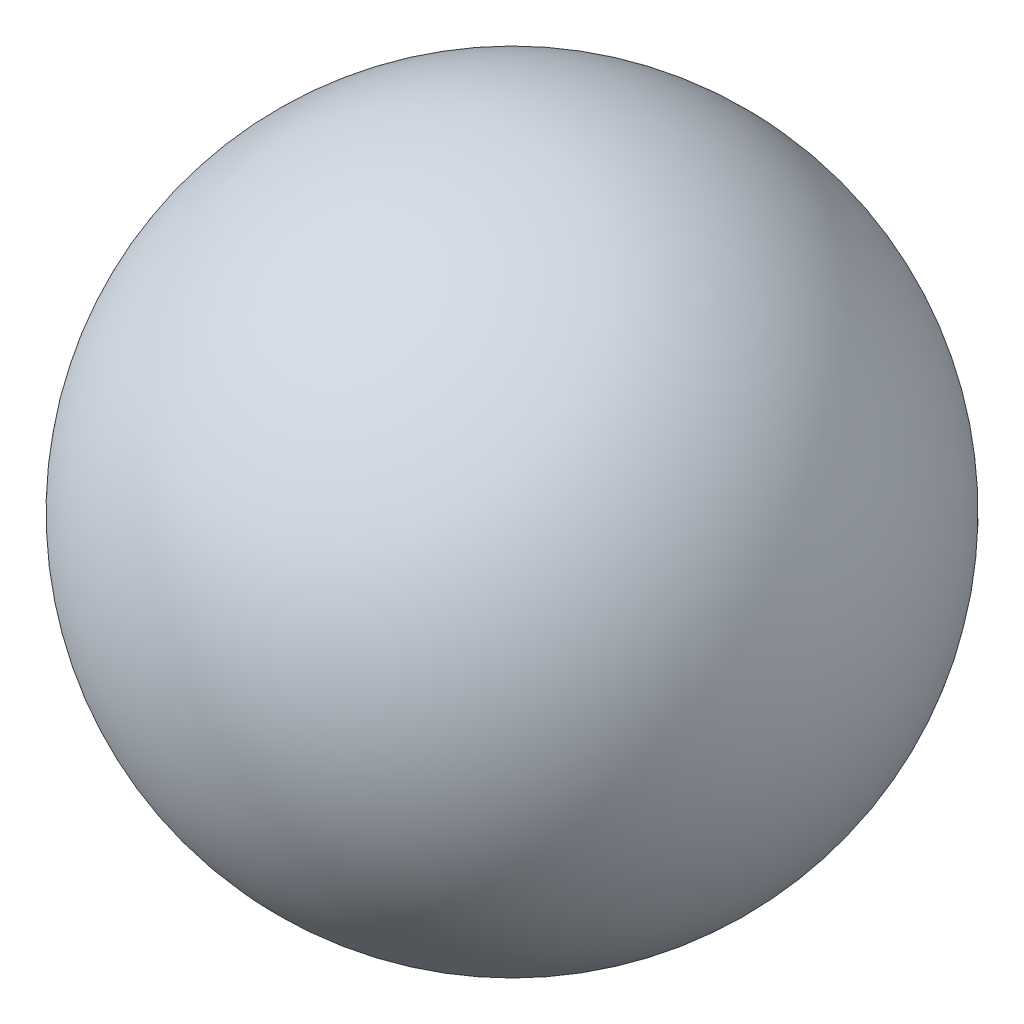
ISO-10303-21;
HEADER;
FILE_DESCRIPTION(('STEP AP214'),'2;1');
FILE_NAME('part.step','',(''),(''),'','','');
FILE_SCHEMA(('AUTOMOTIVE_DESIGN { 1 0 10303 214 1 1 1 1 }'));
ENDSEC;
DATA;
#1=APPLICATION_CONTEXT('core data for automotive mechanical design processes');
#2=APPLICATION_PROTOCOL_DEFINITION('international standard','automotive_design',2000,#1);
#3=PRODUCT_CONTEXT('',#1,'mechanical');
#4=PRODUCT('Part','Part','',(#3));
#5=PRODUCT_RELATED_PRODUCT_CATEGORY('part','',(#4));
#6=PRODUCT_DEFINITION_FORMATION('','',#4);
#7=PRODUCT_DEFINITION_CONTEXT('part definition',#1,'design');
#8=PRODUCT_DEFINITION('design','',#6,#7);
#9=PRODUCT_DEFINITION_SHAPE('','',#8);
#10=(LENGTH_UNIT() NAMED_UNIT(*) SI_UNIT(.MILLI.,.METRE.));
#11=(NAMED_UNIT(*) PLANE_ANGLE_UNIT() SI_UNIT($,.RADIAN.));
#12=(NAMED_UNIT(*) SI_UNIT($,.STERADIAN.) SOLID_ANGLE_UNIT());
#13=UNCERTAINTY_MEASURE_WITH_UNIT(LENGTH_MEASURE(1.E-05),#10,'distance_accuracy_value','');
#14=(GEOMETRIC_REPRESENTATION_CONTEXT(3) GLOBAL_UNCERTAINTY_ASSIGNED_CONTEXT((#13)) GLOBAL_UNIT_ASSIGNED_CONTEXT((#10,
#11,#12)) REPRESENTATION_CONTEXT('',''));
#15=CARTESIAN_POINT('',(0.,0.,0.));
#16=DIRECTION('',(0.,0.,1.));
#17=DIRECTION('',(1.,0.,0.));
#18=AXIS2_PLACEMENT_3D('',#15,#16,#17);
#19=CARTESIAN_POINT('',(64.16,-44.2547799821013,53.4370202924511));
#20=DIRECTION('',(0.,-0.637833186545715,0.770174542646634));
#21=DIRECTION('',(0.173648177666935,-0.758473860771031,-0.628143067238698));
#22=AXIS2_PLACEMENT_3D('',#19,#20,#21);
#23=SPHERICAL_SURFACE('',#22,7.15);
#24=CARTESIAN_POINT('',(64.16,-39.6942726982995,47.9302723125277));
#25=VERTEX_POINT('',#24);
#26=VERTEX_LOOP('',#25);
#27=FACE_BOUND('',#26,.T.);
#28=CARTESIAN_POINT('',(64.16,-48.8152872659031,58.9437682723745));
#29=VERTEX_POINT('',#28);
#30=VERTEX_LOOP('',#29);
#31=FACE_BOUND('',#30,.T.);
#32=ADVANCED_FACE('F19',(#27,#31),#23,.T.);
#33=CLOSED_SHELL('',(#32));
#34=MANIFOLD_SOLID_BREP('B1',#33);
#35=ADVANCED_BREP_SHAPE_REPRESENTATION('',(#18,#34),#14);
#36=SHAPE_DEFINITION_REPRESENTATION(#9,#35);
ENDSEC;
END-ISO-10303-21;
